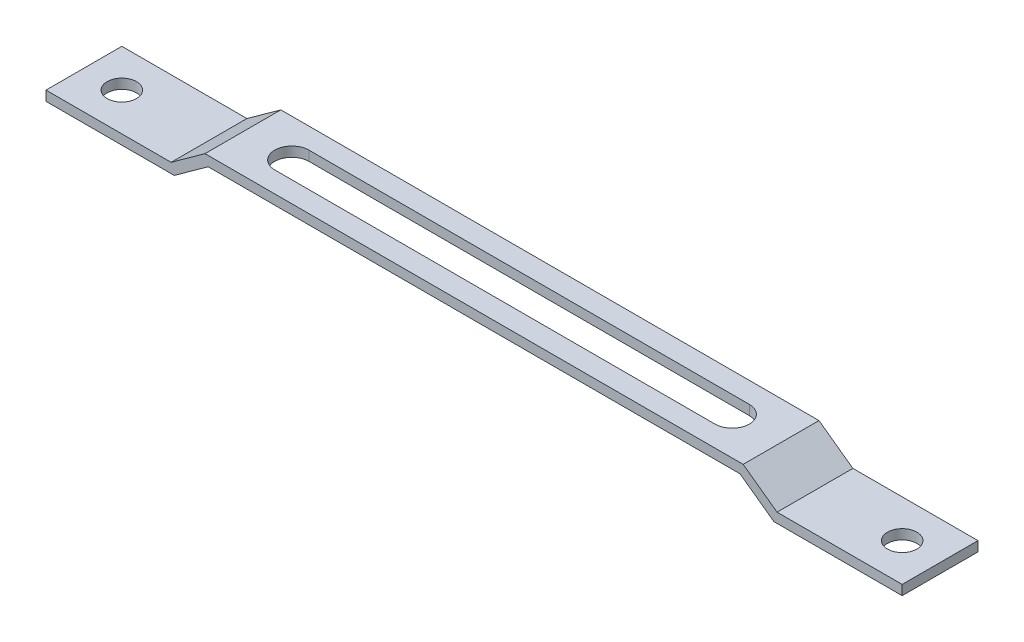
ISO-10303-21;
HEADER;
FILE_DESCRIPTION(('STEP AP214'),'2;1');
FILE_NAME('part.step','',(''),(''),'','','');
FILE_SCHEMA(('AUTOMOTIVE_DESIGN { 1 0 10303 214 1 1 1 1 }'));
ENDSEC;
DATA;
#1=APPLICATION_CONTEXT('core data for automotive mechanical design processes');
#2=APPLICATION_PROTOCOL_DEFINITION('international standard','automotive_design',2000,#1);
#3=PRODUCT_CONTEXT('',#1,'mechanical');
#4=PRODUCT('Part','Part','',(#3));
#5=PRODUCT_RELATED_PRODUCT_CATEGORY('part','',(#4));
#6=PRODUCT_DEFINITION_FORMATION('','',#4);
#7=PRODUCT_DEFINITION_CONTEXT('part definition',#1,'design');
#8=PRODUCT_DEFINITION('design','',#6,#7);
#9=PRODUCT_DEFINITION_SHAPE('','',#8);
#10=(LENGTH_UNIT() NAMED_UNIT(*) SI_UNIT(.MILLI.,.METRE.));
#11=(NAMED_UNIT(*) PLANE_ANGLE_UNIT() SI_UNIT($,.RADIAN.));
#12=(NAMED_UNIT(*) SI_UNIT($,.STERADIAN.) SOLID_ANGLE_UNIT());
#13=UNCERTAINTY_MEASURE_WITH_UNIT(LENGTH_MEASURE(1.E-05),#10,'distance_accuracy_value','');
#14=(GEOMETRIC_REPRESENTATION_CONTEXT(3) GLOBAL_UNCERTAINTY_ASSIGNED_CONTEXT((#13)) GLOBAL_UNIT_ASSIGNED_CONTEXT((#10,
#11,#12)) REPRESENTATION_CONTEXT('',''));
#15=CARTESIAN_POINT('',(0.,0.,0.));
#16=DIRECTION('',(0.,0.,1.));
#17=DIRECTION('',(1.,0.,0.));
#18=AXIS2_PLACEMENT_3D('',#15,#16,#17);
#19=CARTESIAN_POINT('',(61.9282032302756,-1.99999999999998,15.5));
#20=DIRECTION('',(0.,1.,0.));
#21=DIRECTION('',(-1.,0.,0.));
#22=AXIS2_PLACEMENT_3D('',#19,#20,#21);
#23=PLANE('',#22);
#24=CARTESIAN_POINT('',(79.75,-2.,7.75));
#25=DIRECTION('',(0.,1.,0.));
#26=DIRECTION('',(-1.,0.,0.));
#27=AXIS2_PLACEMENT_3D('',#24,#25,#26);
#28=CIRCLE('',#27,3.00000000000017);
#29=CARTESIAN_POINT('',(76.7499999999998,-1.99999999999999,7.75));
#30=VERTEX_POINT('',#29);
#31=EDGE_CURVE('E194',#30,#30,#28,.T.);
#32=ORIENTED_EDGE('',*,*,#31,.T.);
#33=EDGE_LOOP('',(#32));
#34=FACE_BOUND('',#33,.T.);
#35=DIRECTION('',(1.,0.,0.));
#36=VECTOR('',#35,1.);
#37=CARTESIAN_POINT('',(61.9282032302756,-1.99999999999998,0.));
#38=LINE('',#37,#36);
#39=CARTESIAN_POINT('',(61.2818830242588,-1.99999999999998,0.));
#40=VERTEX_POINT('',#39);
#41=CARTESIAN_POINT('',(87.5,-2.,0.));
#42=VERTEX_POINT('',#41);
#43=EDGE_CURVE('E198',#40,#42,#38,.T.);
#44=ORIENTED_EDGE('',*,*,#43,.T.);
#45=DIRECTION('',(0.,0.,-1.));
#46=VECTOR('',#45,1.);
#47=CARTESIAN_POINT('',(87.5,-2.,15.5));
#48=LINE('',#47,#46);
#49=CARTESIAN_POINT('',(87.5,-2.,15.5));
#50=VERTEX_POINT('',#49);
#51=EDGE_CURVE('E322',#50,#42,#48,.T.);
#52=ORIENTED_EDGE('',*,*,#51,.F.);
#53=DIRECTION('',(1.,0.,0.));
#54=VECTOR('',#53,1.);
#55=CARTESIAN_POINT('',(61.9282032302756,-1.99999999999998,15.5));
#56=LINE('',#55,#54);
#57=CARTESIAN_POINT('',(61.2818830242588,-1.99999999999998,15.5));
#58=VERTEX_POINT('',#57);
#59=EDGE_CURVE('E199',#58,#50,#56,.T.);
#60=ORIENTED_EDGE('',*,*,#59,.F.);
#61=DIRECTION('',(0.,0.,-1.));
#62=VECTOR('',#61,1.);
#63=CARTESIAN_POINT('',(61.2818830242588,-1.99999999999998,15.5));
#64=LINE('',#63,#62);
#65=EDGE_CURVE('E243',#58,#40,#64,.T.);
#66=ORIENTED_EDGE('',*,*,#65,.T.);
#67=EDGE_LOOP('',(#44,#52,#60,#66));
#68=FACE_BOUND('',#67,.T.);
#69=ADVANCED_FACE('F39',(#34,#68),#23,.F.);
#70=CARTESIAN_POINT('',(87.5,0.,15.5));
#71=DIRECTION('',(1.,0.,0.));
#72=DIRECTION('',(0.,0.,-1.));
#73=AXIS2_PLACEMENT_3D('',#70,#71,#72);
#74=PLANE('',#73);
#75=DIRECTION('',(0.,-1.,0.));
#76=VECTOR('',#75,1.);
#77=CARTESIAN_POINT('',(87.5,0.,0.));
#78=LINE('',#77,#76);
#79=CARTESIAN_POINT('',(87.5,0.,0.));
#80=VERTEX_POINT('',#79);
#81=EDGE_CURVE('E247',#80,#42,#78,.T.);
#82=ORIENTED_EDGE('',*,*,#81,.F.);
#83=DIRECTION('',(0.,0.,-1.));
#84=VECTOR('',#83,1.);
#85=CARTESIAN_POINT('',(87.5,0.,15.5));
#86=LINE('',#85,#84);
#87=CARTESIAN_POINT('',(87.5,0.,15.5));
#88=VERTEX_POINT('',#87);
#89=EDGE_CURVE('E319',#88,#80,#86,.T.);
#90=ORIENTED_EDGE('',*,*,#89,.F.);
#91=DIRECTION('',(0.,-1.,0.));
#92=VECTOR('',#91,1.);
#93=CARTESIAN_POINT('',(87.5,0.,15.5));
#94=LINE('',#93,#92);
#95=EDGE_CURVE('E202',#88,#50,#94,.T.);
#96=ORIENTED_EDGE('',*,*,#95,.T.);
#97=ORIENTED_EDGE('',*,*,#51,.T.);
#98=EDGE_LOOP('',(#82,#90,#96,#97));
#99=FACE_BOUND('',#98,.T.);
#100=ADVANCED_FACE('F352',(#99),#74,.T.);
#101=CARTESIAN_POINT('',(61.9282032302756,0.,15.5));
#102=DIRECTION('',(0.,1.,0.));
#103=DIRECTION('',(-1.,0.,0.));
#104=AXIS2_PLACEMENT_3D('',#101,#102,#103);
#105=PLANE('',#104);
#106=CARTESIAN_POINT('',(79.75,0.,7.75));
#107=DIRECTION('',(0.,1.,0.));
#108=DIRECTION('',(-1.,0.,0.));
#109=AXIS2_PLACEMENT_3D('',#106,#107,#108);
#110=CIRCLE('',#109,3.00000000000017);
#111=CARTESIAN_POINT('',(76.7499999999998,0.,7.75));
#112=VERTEX_POINT('',#111);
#113=EDGE_CURVE('E42',#112,#112,#110,.T.);
#114=ORIENTED_EDGE('',*,*,#113,.F.);
#115=EDGE_LOOP('',(#114));
#116=FACE_BOUND('',#115,.T.);
#117=DIRECTION('',(1.,0.,0.));
#118=VECTOR('',#117,1.);
#119=CARTESIAN_POINT('',(61.9282032302756,0.,0.));
#120=LINE('',#119,#118);
#121=CARTESIAN_POINT('',(61.9282032302756,0.,0.));
#122=VERTEX_POINT('',#121);
#123=EDGE_CURVE('E251',#122,#80,#120,.T.);
#124=ORIENTED_EDGE('',*,*,#123,.F.);
#125=DIRECTION('',(0.,0.,-1.));
#126=VECTOR('',#125,1.);
#127=CARTESIAN_POINT('',(61.9282032302756,0.,15.5));
#128=LINE('',#127,#126);
#129=CARTESIAN_POINT('',(61.9282032302756,0.,15.5));
#130=VERTEX_POINT('',#129);
#131=EDGE_CURVE('E316',#130,#122,#128,.T.);
#132=ORIENTED_EDGE('',*,*,#131,.F.);
#133=DIRECTION('',(1.,0.,0.));
#134=VECTOR('',#133,1.);
#135=CARTESIAN_POINT('',(61.9282032302756,0.,15.5));
#136=LINE('',#135,#134);
#137=EDGE_CURVE('E207',#130,#88,#136,.T.);
#138=ORIENTED_EDGE('',*,*,#137,.T.);
#139=ORIENTED_EDGE('',*,*,#89,.T.);
#140=EDGE_LOOP('',(#124,#132,#138,#139));
#141=FACE_BOUND('',#140,.T.);
#142=ADVANCED_FACE('F357',(#116,#141),#105,.T.);
#143=CARTESIAN_POINT('',(55.,5.,15.5));
#144=DIRECTION('',(0.585205735980646,0.810884854079388,0.));
#145=DIRECTION('',(-0.810884854079388,0.585205735980646,0.));
#146=AXIS2_PLACEMENT_3D('',#143,#144,#145);
#147=PLANE('',#146);
#148=DIRECTION('',(0.810884854079388,-0.585205735980646,0.));
#149=VECTOR('',#148,1.);
#150=CARTESIAN_POINT('',(55.,5.,0.));
#151=LINE('',#150,#149);
#152=CARTESIAN_POINT('',(55.,5.,0.));
#153=VERTEX_POINT('',#152);
#154=EDGE_CURVE('E255',#153,#122,#151,.T.);
#155=ORIENTED_EDGE('',*,*,#154,.F.);
#156=DIRECTION('',(0.,0.,-1.));
#157=VECTOR('',#156,1.);
#158=CARTESIAN_POINT('',(55.,5.,15.5));
#159=LINE('',#158,#157);
#160=CARTESIAN_POINT('',(55.,5.,15.5));
#161=VERTEX_POINT('',#160);
#162=EDGE_CURVE('E313',#161,#153,#159,.T.);
#163=ORIENTED_EDGE('',*,*,#162,.F.);
#164=DIRECTION('',(0.810884854079388,-0.585205735980646,0.));
#165=VECTOR('',#164,1.);
#166=CARTESIAN_POINT('',(55.,5.,15.5));
#167=LINE('',#166,#165);
#168=EDGE_CURVE('E211',#161,#130,#167,.T.);
#169=ORIENTED_EDGE('',*,*,#168,.T.);
#170=ORIENTED_EDGE('',*,*,#131,.T.);
#171=EDGE_LOOP('',(#155,#163,#169,#170));
#172=FACE_BOUND('',#171,.T.);
#173=ADVANCED_FACE('F378',(#172),#147,.T.);
#174=CARTESIAN_POINT('',(55.,5.,15.5));
#175=DIRECTION('',(0.,1.,0.));
#176=DIRECTION('',(0.,0.,1.));
#177=AXIS2_PLACEMENT_3D('',#174,#175,#176);
#178=PLANE('',#177);
#179=CARTESIAN_POINT('',(45.,5.,7.75));
#180=DIRECTION('',(0.,1.,0.));
#181=DIRECTION('',(0.,0.,1.));
#182=AXIS2_PLACEMENT_3D('',#179,#180,#181);
#183=CIRCLE('',#182,3.5);
#184=CARTESIAN_POINT('',(45.,5.,11.25));
#185=VERTEX_POINT('',#184);
#186=CARTESIAN_POINT('',(45.,5.,4.25));
#187=VERTEX_POINT('',#186);
#188=EDGE_CURVE('E56',#185,#187,#183,.T.);
#189=ORIENTED_EDGE('',*,*,#188,.F.);
#190=DIRECTION('',(1.,0.,0.));
#191=VECTOR('',#190,1.);
#192=CARTESIAN_POINT('',(-45.,5.,11.25));
#193=LINE('',#192,#191);
#194=CARTESIAN_POINT('',(-45.,5.,11.25));
#195=VERTEX_POINT('',#194);
#196=EDGE_CURVE('E175',#195,#185,#193,.T.);
#197=ORIENTED_EDGE('',*,*,#196,.F.);
#198=CARTESIAN_POINT('',(-45.,5.,7.75));
#199=DIRECTION('',(0.,1.,0.));
#200=DIRECTION('',(0.,0.,-1.));
#201=AXIS2_PLACEMENT_3D('',#198,#199,#200);
#202=CIRCLE('',#201,3.5);
#203=CARTESIAN_POINT('',(-45.,5.,4.25));
#204=VERTEX_POINT('',#203);
#205=EDGE_CURVE('E157',#204,#195,#202,.T.);
#206=ORIENTED_EDGE('',*,*,#205,.F.);
#207=DIRECTION('',(-1.,0.,0.));
#208=VECTOR('',#207,1.);
#209=CARTESIAN_POINT('',(-45.,5.,4.25));
#210=LINE('',#209,#208);
#211=EDGE_CURVE('E167',#187,#204,#210,.T.);
#212=ORIENTED_EDGE('',*,*,#211,.F.);
#213=EDGE_LOOP('',(#189,#197,#206,#212));
#214=FACE_BOUND('',#213,.T.);
#215=DIRECTION('',(1.,0.,0.));
#216=VECTOR('',#215,1.);
#217=CARTESIAN_POINT('',(55.,5.,0.));
#218=LINE('',#217,#216);
#219=CARTESIAN_POINT('',(-55.,5.,0.));
#220=VERTEX_POINT('',#219);
#221=EDGE_CURVE('E259',#220,#153,#218,.T.);
#222=ORIENTED_EDGE('',*,*,#221,.F.);
#223=DIRECTION('',(0.,0.,-1.));
#224=VECTOR('',#223,1.);
#225=CARTESIAN_POINT('',(-55.,5.,15.5));
#226=LINE('',#225,#224);
#227=CARTESIAN_POINT('',(-55.,5.,15.5));
#228=VERTEX_POINT('',#227);
#229=EDGE_CURVE('E310',#228,#220,#226,.T.);
#230=ORIENTED_EDGE('',*,*,#229,.F.);
#231=DIRECTION('',(1.,0.,0.));
#232=VECTOR('',#231,1.);
#233=CARTESIAN_POINT('',(55.,5.,15.5));
#234=LINE('',#233,#232);
#235=EDGE_CURVE('E215',#228,#161,#234,.T.);
#236=ORIENTED_EDGE('',*,*,#235,.T.);
#237=ORIENTED_EDGE('',*,*,#162,.T.);
#238=EDGE_LOOP('',(#222,#230,#236,#237));
#239=FACE_BOUND('',#238,.T.);
#240=ADVANCED_FACE('F172',(#214,#239),#178,.T.);
#241=CARTESIAN_POINT('',(-55.,5.,15.5));
#242=DIRECTION('',(-0.585205735980648,0.810884854079387,0.));
#243=DIRECTION('',(-0.810884854079387,-0.585205735980648,0.));
#244=AXIS2_PLACEMENT_3D('',#241,#242,#243);
#245=PLANE('',#244);
#246=DIRECTION('',(0.810884854079387,0.585205735980647,0.));
#247=VECTOR('',#246,1.);
#248=CARTESIAN_POINT('',(-55.,5.,0.));
#249=LINE('',#248,#247);
#250=CARTESIAN_POINT('',(-61.9282032302756,0.,0.));
#251=VERTEX_POINT('',#250);
#252=EDGE_CURVE('E263',#251,#220,#249,.T.);
#253=ORIENTED_EDGE('',*,*,#252,.F.);
#254=DIRECTION('',(0.,0.,-1.));
#255=VECTOR('',#254,1.);
#256=CARTESIAN_POINT('',(-61.9282032302756,0.,15.5));
#257=LINE('',#256,#255);
#258=CARTESIAN_POINT('',(-61.9282032302756,0.,15.5));
#259=VERTEX_POINT('',#258);
#260=EDGE_CURVE('E307',#259,#251,#257,.T.);
#261=ORIENTED_EDGE('',*,*,#260,.F.);
#262=DIRECTION('',(0.810884854079387,0.585205735980647,0.));
#263=VECTOR('',#262,1.);
#264=CARTESIAN_POINT('',(-55.,5.,15.5));
#265=LINE('',#264,#263);
#266=EDGE_CURVE('E219',#259,#228,#265,.T.);
#267=ORIENTED_EDGE('',*,*,#266,.T.);
#268=ORIENTED_EDGE('',*,*,#229,.T.);
#269=EDGE_LOOP('',(#253,#261,#267,#268));
#270=FACE_BOUND('',#269,.T.);
#271=ADVANCED_FACE('F384',(#270),#245,.T.);
#272=CARTESIAN_POINT('',(-61.9282032302756,0.,15.5));
#273=DIRECTION('',(0.,1.,0.));
#274=DIRECTION('',(0.,0.,1.));
#275=AXIS2_PLACEMENT_3D('',#272,#273,#274);
#276=PLANE('',#275);
#277=CARTESIAN_POINT('',(-79.75,0.,7.75));
#278=DIRECTION('',(0.,1.,0.));
#279=DIRECTION('',(0.,0.,1.));
#280=AXIS2_PLACEMENT_3D('',#277,#278,#279);
#281=CIRCLE('',#280,3.00000000000017);
#282=CARTESIAN_POINT('',(-79.75,0.,10.7500000000002));
#283=VERTEX_POINT('',#282);
#284=EDGE_CURVE('E190',#283,#283,#281,.T.);
#285=ORIENTED_EDGE('',*,*,#284,.F.);
#286=EDGE_LOOP('',(#285));
#287=FACE_BOUND('',#286,.T.);
#288=DIRECTION('',(1.,0.,0.));
#289=VECTOR('',#288,1.);
#290=CARTESIAN_POINT('',(-61.9282032302756,0.,0.));
#291=LINE('',#290,#289);
#292=CARTESIAN_POINT('',(-87.5,0.,0.));
#293=VERTEX_POINT('',#292);
#294=EDGE_CURVE('E267',#293,#251,#291,.T.);
#295=ORIENTED_EDGE('',*,*,#294,.F.);
#296=DIRECTION('',(0.,0.,-1.));
#297=VECTOR('',#296,1.);
#298=CARTESIAN_POINT('',(-87.5,0.,15.5));
#299=LINE('',#298,#297);
#300=CARTESIAN_POINT('',(-87.5,0.,15.5));
#301=VERTEX_POINT('',#300);
#302=EDGE_CURVE('E304',#301,#293,#299,.T.);
#303=ORIENTED_EDGE('',*,*,#302,.F.);
#304=DIRECTION('',(1.,0.,0.));
#305=VECTOR('',#304,1.);
#306=CARTESIAN_POINT('',(-61.9282032302756,0.,15.5));
#307=LINE('',#306,#305);
#308=EDGE_CURVE('E223',#301,#259,#307,.T.);
#309=ORIENTED_EDGE('',*,*,#308,.T.);
#310=ORIENTED_EDGE('',*,*,#260,.T.);
#311=EDGE_LOOP('',(#295,#303,#309,#310));
#312=FACE_BOUND('',#311,.T.);
#313=ADVANCED_FACE('F389',(#287,#312),#276,.T.);
#314=CARTESIAN_POINT('',(-87.5,-2.,15.5));
#315=DIRECTION('',(-1.,0.,0.));
#316=DIRECTION('',(0.,0.,1.));
#317=AXIS2_PLACEMENT_3D('',#314,#315,#316);
#318=PLANE('',#317);
#319=DIRECTION('',(0.,1.,0.));
#320=VECTOR('',#319,1.);
#321=CARTESIAN_POINT('',(-87.5,-2.,0.));
#322=LINE('',#321,#320);
#323=CARTESIAN_POINT('',(-87.5,-2.,0.));
#324=VERTEX_POINT('',#323);
#325=EDGE_CURVE('E271',#324,#293,#322,.T.);
#326=ORIENTED_EDGE('',*,*,#325,.F.);
#327=DIRECTION('',(0.,0.,-1.));
#328=VECTOR('',#327,1.);
#329=CARTESIAN_POINT('',(-87.5,-2.,15.5));
#330=LINE('',#329,#328);
#331=CARTESIAN_POINT('',(-87.5,-2.,15.5));
#332=VERTEX_POINT('',#331);
#333=EDGE_CURVE('E301',#332,#324,#330,.T.);
#334=ORIENTED_EDGE('',*,*,#333,.F.);
#335=DIRECTION('',(0.,1.,0.));
#336=VECTOR('',#335,1.);
#337=CARTESIAN_POINT('',(-87.5,-2.,15.5));
#338=LINE('',#337,#336);
#339=EDGE_CURVE('E227',#332,#301,#338,.T.);
#340=ORIENTED_EDGE('',*,*,#339,.T.);
#341=ORIENTED_EDGE('',*,*,#302,.T.);
#342=EDGE_LOOP('',(#326,#334,#340,#341));
#343=FACE_BOUND('',#342,.T.);
#344=ADVANCED_FACE('F392',(#343),#318,.T.);
#345=CARTESIAN_POINT('',(-61.9282032302756,-2.,15.5));
#346=DIRECTION('',(0.,1.,0.));
#347=DIRECTION('',(0.,0.,1.));
#348=AXIS2_PLACEMENT_3D('',#345,#346,#347);
#349=PLANE('',#348);
#350=CARTESIAN_POINT('',(-79.75,-2.,7.75));
#351=DIRECTION('',(0.,1.,0.));
#352=DIRECTION('',(0.,0.,1.));
#353=AXIS2_PLACEMENT_3D('',#350,#351,#352);
#354=CIRCLE('',#353,3.00000000000017);
#355=CARTESIAN_POINT('',(-79.75,-2.,10.7500000000002));
#356=VERTEX_POINT('',#355);
#357=EDGE_CURVE('E185',#356,#356,#354,.T.);
#358=ORIENTED_EDGE('',*,*,#357,.T.);
#359=EDGE_LOOP('',(#358));
#360=FACE_BOUND('',#359,.T.);
#361=DIRECTION('',(1.,0.,0.));
#362=VECTOR('',#361,1.);
#363=CARTESIAN_POINT('',(-61.9282032302756,-2.,0.));
#364=LINE('',#363,#362);
#365=CARTESIAN_POINT('',(-61.2818830242588,-2.,0.));
#366=VERTEX_POINT('',#365);
#367=EDGE_CURVE('E275',#324,#366,#364,.T.);
#368=ORIENTED_EDGE('',*,*,#367,.T.);
#369=DIRECTION('',(0.,0.,-1.));
#370=VECTOR('',#369,1.);
#371=CARTESIAN_POINT('',(-61.2818830242588,-2.,15.5));
#372=LINE('',#371,#370);
#373=CARTESIAN_POINT('',(-61.2818830242588,-2.,15.5));
#374=VERTEX_POINT('',#373);
#375=EDGE_CURVE('E297',#374,#366,#372,.T.);
#376=ORIENTED_EDGE('',*,*,#375,.F.);
#377=DIRECTION('',(1.,0.,0.));
#378=VECTOR('',#377,1.);
#379=CARTESIAN_POINT('',(-61.9282032302756,-2.,15.5));
#380=LINE('',#379,#378);
#381=EDGE_CURVE('E231',#332,#374,#380,.T.);
#382=ORIENTED_EDGE('',*,*,#381,.F.);
#383=ORIENTED_EDGE('',*,*,#333,.T.);
#384=EDGE_LOOP('',(#368,#376,#382,#383));
#385=FACE_BOUND('',#384,.T.);
#386=ADVANCED_FACE('F336',(#360,#385),#349,.F.);
#387=CARTESIAN_POINT('',(-53.8295885280387,3.37823029184123,15.5));
#388=DIRECTION('',(-0.585205735980648,0.810884854079387,0.));
#389=DIRECTION('',(-0.810884854079387,-0.585205735980648,0.));
#390=AXIS2_PLACEMENT_3D('',#387,#388,#389);
#391=PLANE('',#390);
#392=DIRECTION('',(0.810884854079387,0.585205735980648,0.));
#393=VECTOR('',#392,1.);
#394=CARTESIAN_POINT('',(-53.8295885280387,3.37823029184123,0.));
#395=LINE('',#394,#393);
#396=CARTESIAN_POINT('',(-54.3536797939832,3.,0.));
#397=VERTEX_POINT('',#396);
#398=EDGE_CURVE('E278',#366,#397,#395,.T.);
#399=ORIENTED_EDGE('',*,*,#398,.T.);
#400=DIRECTION('',(0.,0.,-1.));
#401=VECTOR('',#400,1.);
#402=CARTESIAN_POINT('',(-54.3536797939832,3.,15.5));
#403=LINE('',#402,#401);
#404=CARTESIAN_POINT('',(-54.3536797939832,3.,15.5));
#405=VERTEX_POINT('',#404);
#406=EDGE_CURVE('E293',#405,#397,#403,.T.);
#407=ORIENTED_EDGE('',*,*,#406,.F.);
#408=DIRECTION('',(0.810884854079387,0.585205735980648,0.));
#409=VECTOR('',#408,1.);
#410=CARTESIAN_POINT('',(-53.8295885280387,3.37823029184123,15.5));
#411=LINE('',#410,#409);
#412=EDGE_CURVE('E234',#374,#405,#411,.T.);
#413=ORIENTED_EDGE('',*,*,#412,.F.);
#414=ORIENTED_EDGE('',*,*,#375,.T.);
#415=EDGE_LOOP('',(#399,#407,#413,#414));
#416=FACE_BOUND('',#415,.T.);
#417=ADVANCED_FACE('F400',(#416),#391,.F.);
#418=CARTESIAN_POINT('',(55.,3.,15.5));
#419=DIRECTION('',(0.,1.,0.));
#420=DIRECTION('',(0.,0.,1.));
#421=AXIS2_PLACEMENT_3D('',#418,#419,#420);
#422=PLANE('',#421);
#423=DIRECTION('',(1.,0.,0.));
#424=VECTOR('',#423,1.);
#425=CARTESIAN_POINT('',(55.,3.,11.25));
#426=LINE('',#425,#424);
#427=CARTESIAN_POINT('',(-45.,3.,11.25));
#428=VERTEX_POINT('',#427);
#429=CARTESIAN_POINT('',(45.,3.,11.25));
#430=VERTEX_POINT('',#429);
#431=EDGE_CURVE('E48',#428,#430,#426,.T.);
#432=ORIENTED_EDGE('',*,*,#431,.T.);
#433=CARTESIAN_POINT('',(45.,3.,7.75));
#434=DIRECTION('',(0.,1.,0.));
#435=DIRECTION('',(0.,0.,1.));
#436=AXIS2_PLACEMENT_3D('',#433,#434,#435);
#437=CIRCLE('',#436,3.5);
#438=CARTESIAN_POINT('',(45.,3.,4.25));
#439=VERTEX_POINT('',#438);
#440=EDGE_CURVE('E11',#430,#439,#437,.T.);
#441=ORIENTED_EDGE('',*,*,#440,.T.);
#442=DIRECTION('',(-1.,0.,0.));
#443=VECTOR('',#442,1.);
#444=CARTESIAN_POINT('',(55.,3.,4.25));
#445=LINE('',#444,#443);
#446=CARTESIAN_POINT('',(-45.,3.,4.25));
#447=VERTEX_POINT('',#446);
#448=EDGE_CURVE('E325',#439,#447,#445,.T.);
#449=ORIENTED_EDGE('',*,*,#448,.T.);
#450=CARTESIAN_POINT('',(-45.,3.,7.75));
#451=DIRECTION('',(0.,1.,0.));
#452=DIRECTION('',(0.,0.,1.));
#453=AXIS2_PLACEMENT_3D('',#450,#451,#452);
#454=CIRCLE('',#453,3.5);
#455=EDGE_CURVE('E160',#447,#428,#454,.T.);
#456=ORIENTED_EDGE('',*,*,#455,.T.);
#457=EDGE_LOOP('',(#432,#441,#449,#456));
#458=FACE_BOUND('',#457,.T.);
#459=DIRECTION('',(1.,0.,0.));
#460=VECTOR('',#459,1.);
#461=CARTESIAN_POINT('',(55.,3.,0.));
#462=LINE('',#461,#460);
#463=CARTESIAN_POINT('',(54.3536797939832,3.,0.));
#464=VERTEX_POINT('',#463);
#465=EDGE_CURVE('E281',#397,#464,#462,.T.);
#466=ORIENTED_EDGE('',*,*,#465,.T.);
#467=DIRECTION('',(0.,0.,-1.));
#468=VECTOR('',#467,1.);
#469=CARTESIAN_POINT('',(54.3536797939832,3.,15.5));
#470=LINE('',#469,#468);
#471=CARTESIAN_POINT('',(54.3536797939832,3.,15.5));
#472=VERTEX_POINT('',#471);
#473=EDGE_CURVE('E289',#472,#464,#470,.T.);
#474=ORIENTED_EDGE('',*,*,#473,.F.);
#475=DIRECTION('',(1.,0.,0.));
#476=VECTOR('',#475,1.);
#477=CARTESIAN_POINT('',(55.,3.,15.5));
#478=LINE('',#477,#476);
#479=EDGE_CURVE('E237',#405,#472,#478,.T.);
#480=ORIENTED_EDGE('',*,*,#479,.F.);
#481=ORIENTED_EDGE('',*,*,#406,.T.);
#482=EDGE_LOOP('',(#466,#474,#480,#481));
#483=FACE_BOUND('',#482,.T.);
#484=ADVANCED_FACE('F405',(#458,#483),#422,.F.);
#485=CARTESIAN_POINT('',(53.8295885280387,3.37823029184122,15.5));
#486=DIRECTION('',(0.585205735980646,0.810884854079388,0.));
#487=DIRECTION('',(-0.810884854079388,0.585205735980646,0.));
#488=AXIS2_PLACEMENT_3D('',#485,#486,#487);
#489=PLANE('',#488);
#490=DIRECTION('',(0.810884854079388,-0.585205735980646,0.));
#491=VECTOR('',#490,1.);
#492=CARTESIAN_POINT('',(53.8295885280387,3.37823029184122,0.));
#493=LINE('',#492,#491);
#494=EDGE_CURVE('E203',#464,#40,#493,.T.);
#495=ORIENTED_EDGE('',*,*,#494,.T.);
#496=ORIENTED_EDGE('',*,*,#65,.F.);
#497=DIRECTION('',(0.810884854079388,-0.585205735980646,0.));
#498=VECTOR('',#497,1.);
#499=CARTESIAN_POINT('',(53.8295885280387,3.37823029184122,15.5));
#500=LINE('',#499,#498);
#501=EDGE_CURVE('E240',#472,#58,#500,.T.);
#502=ORIENTED_EDGE('',*,*,#501,.F.);
#503=ORIENTED_EDGE('',*,*,#473,.T.);
#504=EDGE_LOOP('',(#495,#496,#502,#503));
#505=FACE_BOUND('',#504,.T.);
#506=ADVANCED_FACE('F408',(#505),#489,.F.);
#507=CARTESIAN_POINT('',(0.,0.,15.5));
#508=DIRECTION('',(0.,0.,-1.));
#509=DIRECTION('',(-1.,0.,0.));
#510=AXIS2_PLACEMENT_3D('',#507,#508,#509);
#511=PLANE('',#510);
#512=ORIENTED_EDGE('',*,*,#59,.T.);
#513=ORIENTED_EDGE('',*,*,#95,.F.);
#514=ORIENTED_EDGE('',*,*,#137,.F.);
#515=ORIENTED_EDGE('',*,*,#168,.F.);
#516=ORIENTED_EDGE('',*,*,#235,.F.);
#517=ORIENTED_EDGE('',*,*,#266,.F.);
#518=ORIENTED_EDGE('',*,*,#308,.F.);
#519=ORIENTED_EDGE('',*,*,#339,.F.);
#520=ORIENTED_EDGE('',*,*,#381,.T.);
#521=ORIENTED_EDGE('',*,*,#412,.T.);
#522=ORIENTED_EDGE('',*,*,#479,.T.);
#523=ORIENTED_EDGE('',*,*,#501,.T.);
#524=EDGE_LOOP('',(#512,#513,#514,#515,#516,#517,#518,#519,#520,#521,#522,#523));
#525=FACE_BOUND('',#524,.T.);
#526=ADVANCED_FACE('F373',(#525),#511,.F.);
#527=CARTESIAN_POINT('',(0.,0.,0.));
#528=DIRECTION('',(0.,0.,-1.));
#529=DIRECTION('',(-1.,0.,0.));
#530=AXIS2_PLACEMENT_3D('',#527,#528,#529);
#531=PLANE('',#530);
#532=ORIENTED_EDGE('',*,*,#43,.F.);
#533=ORIENTED_EDGE('',*,*,#494,.F.);
#534=ORIENTED_EDGE('',*,*,#465,.F.);
#535=ORIENTED_EDGE('',*,*,#398,.F.);
#536=ORIENTED_EDGE('',*,*,#367,.F.);
#537=ORIENTED_EDGE('',*,*,#325,.T.);
#538=ORIENTED_EDGE('',*,*,#294,.T.);
#539=ORIENTED_EDGE('',*,*,#252,.T.);
#540=ORIENTED_EDGE('',*,*,#221,.T.);
#541=ORIENTED_EDGE('',*,*,#154,.T.);
#542=ORIENTED_EDGE('',*,*,#123,.T.);
#543=ORIENTED_EDGE('',*,*,#81,.T.);
#544=EDGE_LOOP('',(#532,#533,#534,#535,#536,#537,#538,#539,#540,#541,#542,#543));
#545=FACE_BOUND('',#544,.T.);
#546=ADVANCED_FACE('F368',(#545),#531,.T.);
#547=CARTESIAN_POINT('',(45.,-5.,7.75));
#548=DIRECTION('',(0.,1.,0.));
#549=DIRECTION('',(0.,0.,1.));
#550=AXIS2_PLACEMENT_3D('',#547,#548,#549);
#551=CYLINDRICAL_SURFACE('',#550,3.5);
#552=DIRECTION('',(0.,1.,0.));
#553=VECTOR('',#552,1.);
#554=CARTESIAN_POINT('',(45.,-5.,11.25));
#555=LINE('',#554,#553);
#556=EDGE_CURVE('E182',#430,#185,#555,.T.);
#557=ORIENTED_EDGE('',*,*,#556,.T.);
#558=ORIENTED_EDGE('',*,*,#188,.T.);
#559=DIRECTION('',(0.,1.,0.));
#560=VECTOR('',#559,1.);
#561=CARTESIAN_POINT('',(45.,-5.,4.25));
#562=LINE('',#561,#560);
#563=EDGE_CURVE('E164',#439,#187,#562,.T.);
#564=ORIENTED_EDGE('',*,*,#563,.F.);
#565=ORIENTED_EDGE('',*,*,#440,.F.);
#566=EDGE_LOOP('',(#557,#558,#564,#565));
#567=FACE_BOUND('',#566,.T.);
#568=ADVANCED_FACE('F483',(#567),#551,.F.);
#569=CARTESIAN_POINT('',(-45.,-5.,11.25));
#570=DIRECTION('',(0.,0.,1.));
#571=DIRECTION('',(1.,0.,0.));
#572=AXIS2_PLACEMENT_3D('',#569,#570,#571);
#573=PLANE('',#572);
#574=DIRECTION('',(0.,1.,0.));
#575=VECTOR('',#574,1.);
#576=CARTESIAN_POINT('',(-45.,-5.,11.25));
#577=LINE('',#576,#575);
#578=EDGE_CURVE('E163',#428,#195,#577,.T.);
#579=ORIENTED_EDGE('',*,*,#578,.T.);
#580=ORIENTED_EDGE('',*,*,#196,.T.);
#581=ORIENTED_EDGE('',*,*,#556,.F.);
#582=ORIENTED_EDGE('',*,*,#431,.F.);
#583=EDGE_LOOP('',(#579,#580,#581,#582));
#584=FACE_BOUND('',#583,.T.);
#585=ADVANCED_FACE('F488',(#584),#573,.F.);
#586=CARTESIAN_POINT('',(-45.,-5.,7.75));
#587=DIRECTION('',(0.,1.,0.));
#588=DIRECTION('',(0.,0.,1.));
#589=AXIS2_PLACEMENT_3D('',#586,#587,#588);
#590=CYLINDRICAL_SURFACE('',#589,3.5);
#591=DIRECTION('',(0.,1.,0.));
#592=VECTOR('',#591,1.);
#593=CARTESIAN_POINT('',(-45.,-5.,4.25));
#594=LINE('',#593,#592);
#595=EDGE_CURVE('E64',#447,#204,#594,.T.);
#596=ORIENTED_EDGE('',*,*,#595,.T.);
#597=ORIENTED_EDGE('',*,*,#205,.T.);
#598=ORIENTED_EDGE('',*,*,#578,.F.);
#599=ORIENTED_EDGE('',*,*,#455,.F.);
#600=EDGE_LOOP('',(#596,#597,#598,#599));
#601=FACE_BOUND('',#600,.T.);
#602=ADVANCED_FACE('F154',(#601),#590,.F.);
#603=CARTESIAN_POINT('',(-45.,-5.,4.25));
#604=DIRECTION('',(0.,0.,-1.));
#605=DIRECTION('',(-1.,0.,0.));
#606=AXIS2_PLACEMENT_3D('',#603,#604,#605);
#607=PLANE('',#606);
#608=ORIENTED_EDGE('',*,*,#563,.T.);
#609=ORIENTED_EDGE('',*,*,#211,.T.);
#610=ORIENTED_EDGE('',*,*,#595,.F.);
#611=ORIENTED_EDGE('',*,*,#448,.F.);
#612=EDGE_LOOP('',(#608,#609,#610,#611));
#613=FACE_BOUND('',#612,.T.);
#614=ADVANCED_FACE('F168',(#613),#607,.F.);
#615=CARTESIAN_POINT('',(-79.75,-5.,7.75));
#616=DIRECTION('',(0.,1.,0.));
#617=DIRECTION('',(0.,0.,1.));
#618=AXIS2_PLACEMENT_3D('',#615,#616,#617);
#619=CYLINDRICAL_SURFACE('',#618,3.00000000000017);
#620=ORIENTED_EDGE('',*,*,#284,.T.);
#621=EDGE_LOOP('',(#620));
#622=FACE_BOUND('',#621,.T.);
#623=ORIENTED_EDGE('',*,*,#357,.F.);
#624=EDGE_LOOP('',(#623));
#625=FACE_BOUND('',#624,.T.);
#626=ADVANCED_FACE('F339',(#622,#625),#619,.F.);
#627=CARTESIAN_POINT('',(79.75,-5.,7.75));
#628=DIRECTION('',(0.,1.,0.));
#629=DIRECTION('',(0.,0.,1.));
#630=AXIS2_PLACEMENT_3D('',#627,#628,#629);
#631=CYLINDRICAL_SURFACE('',#630,3.00000000000017);
#632=ORIENTED_EDGE('',*,*,#113,.T.);
#633=EDGE_LOOP('',(#632));
#634=FACE_BOUND('',#633,.T.);
#635=ORIENTED_EDGE('',*,*,#31,.F.);
#636=EDGE_LOOP('',(#635));
#637=FACE_BOUND('',#636,.T.);
#638=ADVANCED_FACE('F341',(#634,#637),#631,.F.);
#639=CLOSED_SHELL('',(#69,#100,#142,#173,#240,#271,#313,#344,#386,#417,#484,#506,#526,#546,#568,
#585,#602,#614,#626,#638));
#640=MANIFOLD_SOLID_BREP('B2',#639);
#641=ADVANCED_BREP_SHAPE_REPRESENTATION('',(#18,#640),#14);
#642=SHAPE_DEFINITION_REPRESENTATION(#9,#641);
ENDSEC;
END-ISO-10303-21;
